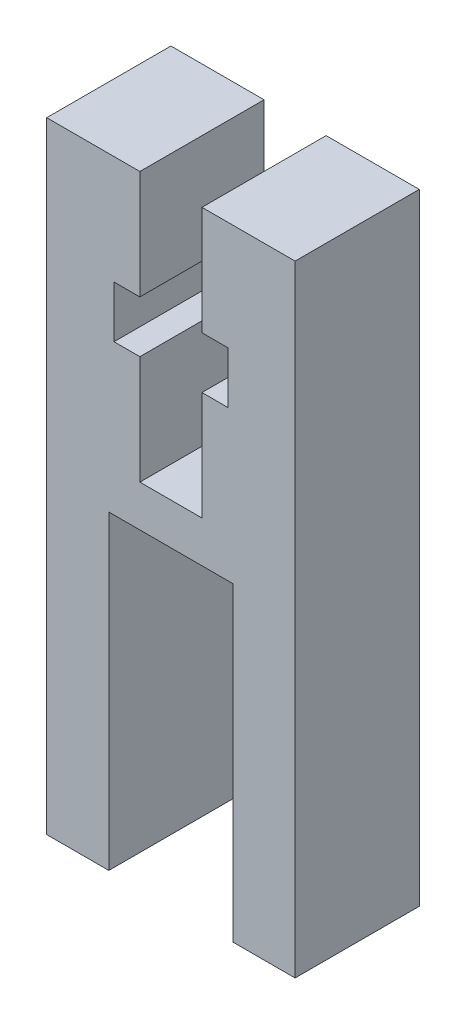
ISO-10303-21;
HEADER;
FILE_DESCRIPTION(('STEP AP214'),'2;1');
FILE_NAME('part.step','',(''),(''),'','','');
FILE_SCHEMA(('AUTOMOTIVE_DESIGN { 1 0 10303 214 1 1 1 1 }'));
ENDSEC;
DATA;
#1=APPLICATION_CONTEXT('core data for automotive mechanical design processes');
#2=APPLICATION_PROTOCOL_DEFINITION('international standard','automotive_design',2000,#1);
#3=PRODUCT_CONTEXT('',#1,'mechanical');
#4=PRODUCT('Part','Part','',(#3));
#5=PRODUCT_RELATED_PRODUCT_CATEGORY('part','',(#4));
#6=PRODUCT_DEFINITION_FORMATION('','',#4);
#7=PRODUCT_DEFINITION_CONTEXT('part definition',#1,'design');
#8=PRODUCT_DEFINITION('design','',#6,#7);
#9=PRODUCT_DEFINITION_SHAPE('','',#8);
#10=(LENGTH_UNIT() NAMED_UNIT(*) SI_UNIT(.MILLI.,.METRE.));
#11=(NAMED_UNIT(*) PLANE_ANGLE_UNIT() SI_UNIT($,.RADIAN.));
#12=(NAMED_UNIT(*) SI_UNIT($,.STERADIAN.) SOLID_ANGLE_UNIT());
#13=UNCERTAINTY_MEASURE_WITH_UNIT(LENGTH_MEASURE(1.E-05),#10,'distance_accuracy_value','');
#14=(GEOMETRIC_REPRESENTATION_CONTEXT(3) GLOBAL_UNCERTAINTY_ASSIGNED_CONTEXT((#13)) GLOBAL_UNIT_ASSIGNED_CONTEXT((#10,
#11,#12)) REPRESENTATION_CONTEXT('',''));
#15=CARTESIAN_POINT('',(0.,0.,0.));
#16=DIRECTION('',(0.,0.,1.));
#17=DIRECTION('',(1.,0.,0.));
#18=AXIS2_PLACEMENT_3D('',#15,#16,#17);
#19=CARTESIAN_POINT('',(-1.5,30.,6.));
#20=DIRECTION('',(0.,-1.,0.));
#21=DIRECTION('',(1.,0.,0.));
#22=AXIS2_PLACEMENT_3D('',#19,#20,#21);
#23=PLANE('',#22);
#24=DIRECTION('',(-1.,0.,0.));
#25=VECTOR('',#24,1.);
#26=CARTESIAN_POINT('',(-1.5,30.,0.));
#27=LINE('',#26,#25);
#28=CARTESIAN_POINT('',(-1.5,30.,0.));
#29=VERTEX_POINT('',#28);
#30=CARTESIAN_POINT('',(-6.,30.,0.));
#31=VERTEX_POINT('',#30);
#32=EDGE_CURVE('E212',#29,#31,#27,.T.);
#33=ORIENTED_EDGE('',*,*,#32,.T.);
#34=DIRECTION('',(0.,0.,-1.));
#35=VECTOR('',#34,1.);
#36=CARTESIAN_POINT('',(-6.,30.,6.));
#37=LINE('',#36,#35);
#38=CARTESIAN_POINT('',(-6.,30.,6.));
#39=VERTEX_POINT('',#38);
#40=EDGE_CURVE('E11',#39,#31,#37,.T.);
#41=ORIENTED_EDGE('',*,*,#40,.F.);
#42=DIRECTION('',(-1.,0.,0.));
#43=VECTOR('',#42,1.);
#44=CARTESIAN_POINT('',(-1.5,30.,6.));
#45=LINE('',#44,#43);
#46=CARTESIAN_POINT('',(-1.5,30.,6.));
#47=VERTEX_POINT('',#46);
#48=EDGE_CURVE('E270',#47,#39,#45,.T.);
#49=ORIENTED_EDGE('',*,*,#48,.F.);
#50=DIRECTION('',(0.,0.,-1.));
#51=VECTOR('',#50,1.);
#52=CARTESIAN_POINT('',(-1.5,30.,6.));
#53=LINE('',#52,#51);
#54=EDGE_CURVE('E208',#47,#29,#53,.T.);
#55=ORIENTED_EDGE('',*,*,#54,.T.);
#56=EDGE_LOOP('',(#33,#41,#49,#55));
#57=FACE_BOUND('',#56,.T.);
#58=ADVANCED_FACE('F39',(#57),#23,.F.);
#59=CARTESIAN_POINT('',(-6.,30.,6.));
#60=DIRECTION('',(1.,0.,0.));
#61=DIRECTION('',(0.,1.,0.));
#62=AXIS2_PLACEMENT_3D('',#59,#60,#61);
#63=PLANE('',#62);
#64=DIRECTION('',(0.,-1.,0.));
#65=VECTOR('',#64,1.);
#66=CARTESIAN_POINT('',(-6.,30.,0.));
#67=LINE('',#66,#65);
#68=CARTESIAN_POINT('',(-5.99999999999999,0.,0.));
#69=VERTEX_POINT('',#68);
#70=EDGE_CURVE('E216',#31,#69,#67,.T.);
#71=ORIENTED_EDGE('',*,*,#70,.T.);
#72=DIRECTION('',(0.,0.,-1.));
#73=VECTOR('',#72,1.);
#74=CARTESIAN_POINT('',(-5.99999999999999,0.,6.));
#75=LINE('',#74,#73);
#76=CARTESIAN_POINT('',(-5.99999999999999,0.,6.));
#77=VERTEX_POINT('',#76);
#78=EDGE_CURVE('E48',#77,#69,#75,.T.);
#79=ORIENTED_EDGE('',*,*,#78,.F.);
#80=DIRECTION('',(0.,-1.,0.));
#81=VECTOR('',#80,1.);
#82=CARTESIAN_POINT('',(-6.,30.,6.));
#83=LINE('',#82,#81);
#84=EDGE_CURVE('E135',#39,#77,#83,.T.);
#85=ORIENTED_EDGE('',*,*,#84,.F.);
#86=ORIENTED_EDGE('',*,*,#40,.T.);
#87=EDGE_LOOP('',(#71,#79,#85,#86));
#88=FACE_BOUND('',#87,.T.);
#89=ADVANCED_FACE('F420',(#88),#63,.F.);
#90=CARTESIAN_POINT('',(-5.99999999999999,0.,6.));
#91=DIRECTION('',(0.,1.,0.));
#92=DIRECTION('',(0.,0.,1.));
#93=AXIS2_PLACEMENT_3D('',#90,#91,#92);
#94=PLANE('',#93);
#95=DIRECTION('',(1.,0.,0.));
#96=VECTOR('',#95,1.);
#97=CARTESIAN_POINT('',(-5.99999999999999,0.,0.));
#98=LINE('',#97,#96);
#99=CARTESIAN_POINT('',(-3.,0.,0.));
#100=VERTEX_POINT('',#99);
#101=EDGE_CURVE('E219',#69,#100,#98,.T.);
#102=ORIENTED_EDGE('',*,*,#101,.T.);
#103=DIRECTION('',(0.,0.,-1.));
#104=VECTOR('',#103,1.);
#105=CARTESIAN_POINT('',(-3.,0.,6.));
#106=LINE('',#105,#104);
#107=CARTESIAN_POINT('',(-3.,0.,6.));
#108=VERTEX_POINT('',#107);
#109=EDGE_CURVE('E329',#108,#100,#106,.T.);
#110=ORIENTED_EDGE('',*,*,#109,.F.);
#111=DIRECTION('',(1.,0.,0.));
#112=VECTOR('',#111,1.);
#113=CARTESIAN_POINT('',(-5.99999999999999,0.,6.));
#114=LINE('',#113,#112);
#115=EDGE_CURVE('E339',#77,#108,#114,.T.);
#116=ORIENTED_EDGE('',*,*,#115,.F.);
#117=ORIENTED_EDGE('',*,*,#78,.T.);
#118=EDGE_LOOP('',(#102,#110,#116,#117));
#119=FACE_BOUND('',#118,.T.);
#120=ADVANCED_FACE('F337',(#119),#94,.F.);
#121=CARTESIAN_POINT('',(-3.,0.,6.));
#122=DIRECTION('',(-1.,0.,0.));
#123=DIRECTION('',(0.,0.,1.));
#124=AXIS2_PLACEMENT_3D('',#121,#122,#123);
#125=PLANE('',#124);
#126=DIRECTION('',(0.,1.,0.));
#127=VECTOR('',#126,1.);
#128=CARTESIAN_POINT('',(-3.,0.,0.));
#129=LINE('',#128,#127);
#130=CARTESIAN_POINT('',(-3.,15.,0.));
#131=VERTEX_POINT('',#130);
#132=EDGE_CURVE('E222',#100,#131,#129,.T.);
#133=ORIENTED_EDGE('',*,*,#132,.T.);
#134=DIRECTION('',(0.,0.,-1.));
#135=VECTOR('',#134,1.);
#136=CARTESIAN_POINT('',(-3.,15.,6.));
#137=LINE('',#136,#135);
#138=CARTESIAN_POINT('',(-3.,15.,6.));
#139=VERTEX_POINT('',#138);
#140=EDGE_CURVE('E325',#139,#131,#137,.T.);
#141=ORIENTED_EDGE('',*,*,#140,.F.);
#142=DIRECTION('',(0.,1.,0.));
#143=VECTOR('',#142,1.);
#144=CARTESIAN_POINT('',(-3.,0.,6.));
#145=LINE('',#144,#143);
#146=EDGE_CURVE('E358',#108,#139,#145,.T.);
#147=ORIENTED_EDGE('',*,*,#146,.F.);
#148=ORIENTED_EDGE('',*,*,#109,.T.);
#149=EDGE_LOOP('',(#133,#141,#147,#148));
#150=FACE_BOUND('',#149,.T.);
#151=ADVANCED_FACE('F348',(#150),#125,.F.);
#152=CARTESIAN_POINT('',(-3.,15.,6.));
#153=DIRECTION('',(0.,1.,0.));
#154=DIRECTION('',(0.,0.,1.));
#155=AXIS2_PLACEMENT_3D('',#152,#153,#154);
#156=PLANE('',#155);
#157=DIRECTION('',(1.,0.,0.));
#158=VECTOR('',#157,1.);
#159=CARTESIAN_POINT('',(-3.,15.,0.));
#160=LINE('',#159,#158);
#161=CARTESIAN_POINT('',(3.,15.,0.));
#162=VERTEX_POINT('',#161);
#163=EDGE_CURVE('E225',#131,#162,#160,.T.);
#164=ORIENTED_EDGE('',*,*,#163,.T.);
#165=DIRECTION('',(0.,0.,-1.));
#166=VECTOR('',#165,1.);
#167=CARTESIAN_POINT('',(3.,15.,6.));
#168=LINE('',#167,#166);
#169=CARTESIAN_POINT('',(3.,15.,6.));
#170=VERTEX_POINT('',#169);
#171=EDGE_CURVE('E321',#170,#162,#168,.T.);
#172=ORIENTED_EDGE('',*,*,#171,.F.);
#173=DIRECTION('',(1.,0.,0.));
#174=VECTOR('',#173,1.);
#175=CARTESIAN_POINT('',(-3.,15.,6.));
#176=LINE('',#175,#174);
#177=EDGE_CURVE('E354',#139,#170,#176,.T.);
#178=ORIENTED_EDGE('',*,*,#177,.F.);
#179=ORIENTED_EDGE('',*,*,#140,.T.);
#180=EDGE_LOOP('',(#164,#172,#178,#179));
#181=FACE_BOUND('',#180,.T.);
#182=ADVANCED_FACE('F352',(#181),#156,.F.);
#183=CARTESIAN_POINT('',(3.,0.,6.));
#184=DIRECTION('',(1.,0.,0.));
#185=DIRECTION('',(0.,0.,-1.));
#186=AXIS2_PLACEMENT_3D('',#183,#184,#185);
#187=PLANE('',#186);
#188=DIRECTION('',(0.,-1.,0.));
#189=VECTOR('',#188,1.);
#190=CARTESIAN_POINT('',(3.,0.,0.));
#191=LINE('',#190,#189);
#192=CARTESIAN_POINT('',(3.,0.,0.));
#193=VERTEX_POINT('',#192);
#194=EDGE_CURVE('E228',#162,#193,#191,.T.);
#195=ORIENTED_EDGE('',*,*,#194,.T.);
#196=DIRECTION('',(0.,0.,-1.));
#197=VECTOR('',#196,1.);
#198=CARTESIAN_POINT('',(3.,0.,6.));
#199=LINE('',#198,#197);
#200=CARTESIAN_POINT('',(3.,0.,6.));
#201=VERTEX_POINT('',#200);
#202=EDGE_CURVE('E317',#201,#193,#199,.T.);
#203=ORIENTED_EDGE('',*,*,#202,.F.);
#204=DIRECTION('',(0.,-1.,0.));
#205=VECTOR('',#204,1.);
#206=CARTESIAN_POINT('',(3.,0.,6.));
#207=LINE('',#206,#205);
#208=EDGE_CURVE('E357',#170,#201,#207,.T.);
#209=ORIENTED_EDGE('',*,*,#208,.F.);
#210=ORIENTED_EDGE('',*,*,#171,.T.);
#211=EDGE_LOOP('',(#195,#203,#209,#210));
#212=FACE_BOUND('',#211,.T.);
#213=ADVANCED_FACE('F433',(#212),#187,.F.);
#214=CARTESIAN_POINT('',(5.99999999999999,0.,6.));
#215=DIRECTION('',(0.,1.,0.));
#216=DIRECTION('',(0.,0.,1.));
#217=AXIS2_PLACEMENT_3D('',#214,#215,#216);
#218=PLANE('',#217);
#219=DIRECTION('',(1.,0.,0.));
#220=VECTOR('',#219,1.);
#221=CARTESIAN_POINT('',(5.99999999999999,0.,0.));
#222=LINE('',#221,#220);
#223=CARTESIAN_POINT('',(5.99999999999999,0.,0.));
#224=VERTEX_POINT('',#223);
#225=EDGE_CURVE('E231',#193,#224,#222,.T.);
#226=ORIENTED_EDGE('',*,*,#225,.T.);
#227=DIRECTION('',(0.,0.,-1.));
#228=VECTOR('',#227,1.);
#229=CARTESIAN_POINT('',(5.99999999999999,0.,6.));
#230=LINE('',#229,#228);
#231=CARTESIAN_POINT('',(5.99999999999999,0.,6.));
#232=VERTEX_POINT('',#231);
#233=EDGE_CURVE('E313',#232,#224,#230,.T.);
#234=ORIENTED_EDGE('',*,*,#233,.F.);
#235=DIRECTION('',(1.,0.,0.));
#236=VECTOR('',#235,1.);
#237=CARTESIAN_POINT('',(5.99999999999999,0.,6.));
#238=LINE('',#237,#236);
#239=EDGE_CURVE('E362',#201,#232,#238,.T.);
#240=ORIENTED_EDGE('',*,*,#239,.F.);
#241=ORIENTED_EDGE('',*,*,#202,.T.);
#242=EDGE_LOOP('',(#226,#234,#240,#241));
#243=FACE_BOUND('',#242,.T.);
#244=ADVANCED_FACE('F436',(#243),#218,.F.);
#245=CARTESIAN_POINT('',(6.,30.,6.));
#246=DIRECTION('',(-1.,0.,0.));
#247=DIRECTION('',(0.,-1.,0.));
#248=AXIS2_PLACEMENT_3D('',#245,#246,#247);
#249=PLANE('',#248);
#250=DIRECTION('',(0.,1.,0.));
#251=VECTOR('',#250,1.);
#252=CARTESIAN_POINT('',(6.,30.,0.));
#253=LINE('',#252,#251);
#254=CARTESIAN_POINT('',(6.,30.,0.));
#255=VERTEX_POINT('',#254);
#256=EDGE_CURVE('E234',#224,#255,#253,.T.);
#257=ORIENTED_EDGE('',*,*,#256,.T.);
#258=DIRECTION('',(0.,0.,-1.));
#259=VECTOR('',#258,1.);
#260=CARTESIAN_POINT('',(6.,30.,6.));
#261=LINE('',#260,#259);
#262=CARTESIAN_POINT('',(6.,30.,6.));
#263=VERTEX_POINT('',#262);
#264=EDGE_CURVE('E309',#263,#255,#261,.T.);
#265=ORIENTED_EDGE('',*,*,#264,.F.);
#266=DIRECTION('',(0.,1.,0.));
#267=VECTOR('',#266,1.);
#268=CARTESIAN_POINT('',(6.,30.,6.));
#269=LINE('',#268,#267);
#270=EDGE_CURVE('E369',#232,#263,#269,.T.);
#271=ORIENTED_EDGE('',*,*,#270,.F.);
#272=ORIENTED_EDGE('',*,*,#233,.T.);
#273=EDGE_LOOP('',(#257,#265,#271,#272));
#274=FACE_BOUND('',#273,.T.);
#275=ADVANCED_FACE('F440',(#274),#249,.F.);
#276=CARTESIAN_POINT('',(1.5,30.,6.));
#277=DIRECTION('',(0.,-1.,0.));
#278=DIRECTION('',(1.,0.,0.));
#279=AXIS2_PLACEMENT_3D('',#276,#277,#278);
#280=PLANE('',#279);
#281=DIRECTION('',(-1.,0.,0.));
#282=VECTOR('',#281,1.);
#283=CARTESIAN_POINT('',(1.5,30.,0.));
#284=LINE('',#283,#282);
#285=CARTESIAN_POINT('',(1.5,30.,0.));
#286=VERTEX_POINT('',#285);
#287=EDGE_CURVE('E237',#255,#286,#284,.T.);
#288=ORIENTED_EDGE('',*,*,#287,.T.);
#289=DIRECTION('',(0.,0.,-1.));
#290=VECTOR('',#289,1.);
#291=CARTESIAN_POINT('',(1.5,30.,6.));
#292=LINE('',#291,#290);
#293=CARTESIAN_POINT('',(1.5,30.,6.));
#294=VERTEX_POINT('',#293);
#295=EDGE_CURVE('E305',#294,#286,#292,.T.);
#296=ORIENTED_EDGE('',*,*,#295,.F.);
#297=DIRECTION('',(-1.,0.,0.));
#298=VECTOR('',#297,1.);
#299=CARTESIAN_POINT('',(1.5,30.,6.));
#300=LINE('',#299,#298);
#301=EDGE_CURVE('E372',#263,#294,#300,.T.);
#302=ORIENTED_EDGE('',*,*,#301,.F.);
#303=ORIENTED_EDGE('',*,*,#264,.T.);
#304=EDGE_LOOP('',(#288,#296,#302,#303));
#305=FACE_BOUND('',#304,.T.);
#306=ADVANCED_FACE('F444',(#305),#280,.F.);
#307=CARTESIAN_POINT('',(1.5,30.,6.));
#308=DIRECTION('',(1.,0.,0.));
#309=DIRECTION('',(0.,1.,0.));
#310=AXIS2_PLACEMENT_3D('',#307,#308,#309);
#311=PLANE('',#310);
#312=DIRECTION('',(0.,-1.,0.));
#313=VECTOR('',#312,1.);
#314=CARTESIAN_POINT('',(1.5,30.,0.));
#315=LINE('',#314,#313);
#316=CARTESIAN_POINT('',(1.5,24.75,0.));
#317=VERTEX_POINT('',#316);
#318=EDGE_CURVE('E240',#286,#317,#315,.T.);
#319=ORIENTED_EDGE('',*,*,#318,.T.);
#320=DIRECTION('',(0.,0.,-1.));
#321=VECTOR('',#320,1.);
#322=CARTESIAN_POINT('',(1.5,24.75,6.));
#323=LINE('',#322,#321);
#324=CARTESIAN_POINT('',(1.5,24.75,6.));
#325=VERTEX_POINT('',#324);
#326=EDGE_CURVE('E301',#325,#317,#323,.T.);
#327=ORIENTED_EDGE('',*,*,#326,.F.);
#328=DIRECTION('',(0.,-1.,0.));
#329=VECTOR('',#328,1.);
#330=CARTESIAN_POINT('',(1.5,30.,6.));
#331=LINE('',#330,#329);
#332=EDGE_CURVE('E375',#294,#325,#331,.T.);
#333=ORIENTED_EDGE('',*,*,#332,.F.);
#334=ORIENTED_EDGE('',*,*,#295,.T.);
#335=EDGE_LOOP('',(#319,#327,#333,#334));
#336=FACE_BOUND('',#335,.T.);
#337=ADVANCED_FACE('F448',(#336),#311,.F.);
#338=CARTESIAN_POINT('',(1.5,24.75,6.));
#339=DIRECTION('',(0.,1.,0.));
#340=DIRECTION('',(0.,0.,1.));
#341=AXIS2_PLACEMENT_3D('',#338,#339,#340);
#342=PLANE('',#341);
#343=DIRECTION('',(1.,0.,0.));
#344=VECTOR('',#343,1.);
#345=CARTESIAN_POINT('',(1.5,24.75,0.));
#346=LINE('',#345,#344);
#347=CARTESIAN_POINT('',(2.75,24.75,0.));
#348=VERTEX_POINT('',#347);
#349=EDGE_CURVE('E243',#317,#348,#346,.T.);
#350=ORIENTED_EDGE('',*,*,#349,.T.);
#351=DIRECTION('',(0.,0.,-1.));
#352=VECTOR('',#351,1.);
#353=CARTESIAN_POINT('',(2.75,24.75,6.));
#354=LINE('',#353,#352);
#355=CARTESIAN_POINT('',(2.75,24.75,6.));
#356=VERTEX_POINT('',#355);
#357=EDGE_CURVE('E297',#356,#348,#354,.T.);
#358=ORIENTED_EDGE('',*,*,#357,.F.);
#359=DIRECTION('',(1.,0.,0.));
#360=VECTOR('',#359,1.);
#361=CARTESIAN_POINT('',(1.5,24.75,6.));
#362=LINE('',#361,#360);
#363=EDGE_CURVE('E378',#325,#356,#362,.T.);
#364=ORIENTED_EDGE('',*,*,#363,.F.);
#365=ORIENTED_EDGE('',*,*,#326,.T.);
#366=EDGE_LOOP('',(#350,#358,#364,#365));
#367=FACE_BOUND('',#366,.T.);
#368=ADVANCED_FACE('F452',(#367),#342,.F.);
#369=CARTESIAN_POINT('',(2.75,24.75,6.));
#370=DIRECTION('',(1.,0.,0.));
#371=DIRECTION('',(0.,0.,-1.));
#372=AXIS2_PLACEMENT_3D('',#369,#370,#371);
#373=PLANE('',#372);
#374=DIRECTION('',(0.,-1.,0.));
#375=VECTOR('',#374,1.);
#376=CARTESIAN_POINT('',(2.75,24.75,0.));
#377=LINE('',#376,#375);
#378=CARTESIAN_POINT('',(2.75,22.25,0.));
#379=VERTEX_POINT('',#378);
#380=EDGE_CURVE('E246',#348,#379,#377,.T.);
#381=ORIENTED_EDGE('',*,*,#380,.T.);
#382=DIRECTION('',(0.,0.,-1.));
#383=VECTOR('',#382,1.);
#384=CARTESIAN_POINT('',(2.75,22.25,6.));
#385=LINE('',#384,#383);
#386=CARTESIAN_POINT('',(2.75,22.25,6.));
#387=VERTEX_POINT('',#386);
#388=EDGE_CURVE('E293',#387,#379,#385,.T.);
#389=ORIENTED_EDGE('',*,*,#388,.F.);
#390=DIRECTION('',(0.,-1.,0.));
#391=VECTOR('',#390,1.);
#392=CARTESIAN_POINT('',(2.75,24.75,6.));
#393=LINE('',#392,#391);
#394=EDGE_CURVE('E381',#356,#387,#393,.T.);
#395=ORIENTED_EDGE('',*,*,#394,.F.);
#396=ORIENTED_EDGE('',*,*,#357,.T.);
#397=EDGE_LOOP('',(#381,#389,#395,#396));
#398=FACE_BOUND('',#397,.T.);
#399=ADVANCED_FACE('F456',(#398),#373,.F.);
#400=CARTESIAN_POINT('',(2.75,22.25,6.));
#401=DIRECTION('',(0.,-1.,0.));
#402=DIRECTION('',(0.,0.,-1.));
#403=AXIS2_PLACEMENT_3D('',#400,#401,#402);
#404=PLANE('',#403);
#405=DIRECTION('',(-1.,0.,0.));
#406=VECTOR('',#405,1.);
#407=CARTESIAN_POINT('',(2.75,22.25,0.));
#408=LINE('',#407,#406);
#409=CARTESIAN_POINT('',(1.5,22.25,0.));
#410=VERTEX_POINT('',#409);
#411=EDGE_CURVE('E249',#379,#410,#408,.T.);
#412=ORIENTED_EDGE('',*,*,#411,.T.);
#413=DIRECTION('',(0.,0.,-1.));
#414=VECTOR('',#413,1.);
#415=CARTESIAN_POINT('',(1.5,22.25,6.));
#416=LINE('',#415,#414);
#417=CARTESIAN_POINT('',(1.5,22.25,6.));
#418=VERTEX_POINT('',#417);
#419=EDGE_CURVE('E289',#418,#410,#416,.T.);
#420=ORIENTED_EDGE('',*,*,#419,.F.);
#421=DIRECTION('',(-1.,0.,0.));
#422=VECTOR('',#421,1.);
#423=CARTESIAN_POINT('',(2.75,22.25,6.));
#424=LINE('',#423,#422);
#425=EDGE_CURVE('E384',#387,#418,#424,.T.);
#426=ORIENTED_EDGE('',*,*,#425,.F.);
#427=ORIENTED_EDGE('',*,*,#388,.T.);
#428=EDGE_LOOP('',(#412,#420,#426,#427));
#429=FACE_BOUND('',#428,.T.);
#430=ADVANCED_FACE('F460',(#429),#404,.F.);
#431=CARTESIAN_POINT('',(1.5,22.25,6.));
#432=DIRECTION('',(1.,0.,0.));
#433=DIRECTION('',(0.,1.,0.));
#434=AXIS2_PLACEMENT_3D('',#431,#432,#433);
#435=PLANE('',#434);
#436=DIRECTION('',(0.,-1.,0.));
#437=VECTOR('',#436,1.);
#438=CARTESIAN_POINT('',(1.5,22.25,0.));
#439=LINE('',#438,#437);
#440=CARTESIAN_POINT('',(1.5,17.0000000000001,0.));
#441=VERTEX_POINT('',#440);
#442=EDGE_CURVE('E252',#410,#441,#439,.T.);
#443=ORIENTED_EDGE('',*,*,#442,.T.);
#444=DIRECTION('',(0.,0.,-1.));
#445=VECTOR('',#444,1.);
#446=CARTESIAN_POINT('',(1.5,17.0000000000001,6.));
#447=LINE('',#446,#445);
#448=CARTESIAN_POINT('',(1.5,17.0000000000001,6.));
#449=VERTEX_POINT('',#448);
#450=EDGE_CURVE('E285',#449,#441,#447,.T.);
#451=ORIENTED_EDGE('',*,*,#450,.F.);
#452=DIRECTION('',(0.,-1.,0.));
#453=VECTOR('',#452,1.);
#454=CARTESIAN_POINT('',(1.5,22.25,6.));
#455=LINE('',#454,#453);
#456=EDGE_CURVE('E387',#418,#449,#455,.T.);
#457=ORIENTED_EDGE('',*,*,#456,.F.);
#458=ORIENTED_EDGE('',*,*,#419,.T.);
#459=EDGE_LOOP('',(#443,#451,#457,#458));
#460=FACE_BOUND('',#459,.T.);
#461=ADVANCED_FACE('F464',(#460),#435,.F.);
#462=CARTESIAN_POINT('',(-1.5,17.,6.));
#463=DIRECTION('',(0.,-1.,0.));
#464=DIRECTION('',(1.,0.,0.));
#465=AXIS2_PLACEMENT_3D('',#462,#463,#464);
#466=PLANE('',#465);
#467=DIRECTION('',(-1.,0.,0.));
#468=VECTOR('',#467,1.);
#469=CARTESIAN_POINT('',(-1.5,17.,0.));
#470=LINE('',#469,#468);
#471=CARTESIAN_POINT('',(-1.5,17.,0.));
#472=VERTEX_POINT('',#471);
#473=EDGE_CURVE('E255',#441,#472,#470,.T.);
#474=ORIENTED_EDGE('',*,*,#473,.T.);
#475=DIRECTION('',(0.,0.,-1.));
#476=VECTOR('',#475,1.);
#477=CARTESIAN_POINT('',(-1.5,17.,6.));
#478=LINE('',#477,#476);
#479=CARTESIAN_POINT('',(-1.5,17.,6.));
#480=VERTEX_POINT('',#479);
#481=EDGE_CURVE('E281',#480,#472,#478,.T.);
#482=ORIENTED_EDGE('',*,*,#481,.F.);
#483=DIRECTION('',(-1.,0.,0.));
#484=VECTOR('',#483,1.);
#485=CARTESIAN_POINT('',(-1.5,17.,6.));
#486=LINE('',#485,#484);
#487=EDGE_CURVE('E390',#449,#480,#486,.T.);
#488=ORIENTED_EDGE('',*,*,#487,.F.);
#489=ORIENTED_EDGE('',*,*,#450,.T.);
#490=EDGE_LOOP('',(#474,#482,#488,#489));
#491=FACE_BOUND('',#490,.T.);
#492=ADVANCED_FACE('F468',(#491),#466,.F.);
#493=CARTESIAN_POINT('',(-1.5,22.25,6.));
#494=DIRECTION('',(-1.,0.,0.));
#495=DIRECTION('',(0.,-1.,0.));
#496=AXIS2_PLACEMENT_3D('',#493,#494,#495);
#497=PLANE('',#496);
#498=DIRECTION('',(0.,1.,0.));
#499=VECTOR('',#498,1.);
#500=CARTESIAN_POINT('',(-1.5,22.25,0.));
#501=LINE('',#500,#499);
#502=CARTESIAN_POINT('',(-1.5,22.25,0.));
#503=VERTEX_POINT('',#502);
#504=EDGE_CURVE('E258',#472,#503,#501,.T.);
#505=ORIENTED_EDGE('',*,*,#504,.T.);
#506=DIRECTION('',(0.,0.,-1.));
#507=VECTOR('',#506,1.);
#508=CARTESIAN_POINT('',(-1.5,22.25,6.));
#509=LINE('',#508,#507);
#510=CARTESIAN_POINT('',(-1.5,22.25,6.));
#511=VERTEX_POINT('',#510);
#512=EDGE_CURVE('E277',#511,#503,#509,.T.);
#513=ORIENTED_EDGE('',*,*,#512,.F.);
#514=DIRECTION('',(0.,1.,0.));
#515=VECTOR('',#514,1.);
#516=CARTESIAN_POINT('',(-1.5,22.25,6.));
#517=LINE('',#516,#515);
#518=EDGE_CURVE('E393',#480,#511,#517,.T.);
#519=ORIENTED_EDGE('',*,*,#518,.F.);
#520=ORIENTED_EDGE('',*,*,#481,.T.);
#521=EDGE_LOOP('',(#505,#513,#519,#520));
#522=FACE_BOUND('',#521,.T.);
#523=ADVANCED_FACE('F401',(#522),#497,.F.);
#524=CARTESIAN_POINT('',(-2.75,22.25,6.));
#525=DIRECTION('',(0.,-1.,0.));
#526=DIRECTION('',(0.,0.,-1.));
#527=AXIS2_PLACEMENT_3D('',#524,#525,#526);
#528=PLANE('',#527);
#529=DIRECTION('',(-1.,0.,0.));
#530=VECTOR('',#529,1.);
#531=CARTESIAN_POINT('',(-2.75,22.25,0.));
#532=LINE('',#531,#530);
#533=CARTESIAN_POINT('',(-2.75,22.25,0.));
#534=VERTEX_POINT('',#533);
#535=EDGE_CURVE('E261',#503,#534,#532,.T.);
#536=ORIENTED_EDGE('',*,*,#535,.T.);
#537=DIRECTION('',(0.,0.,-1.));
#538=VECTOR('',#537,1.);
#539=CARTESIAN_POINT('',(-2.75,22.25,6.));
#540=LINE('',#539,#538);
#541=CARTESIAN_POINT('',(-2.75,22.25,6.));
#542=VERTEX_POINT('',#541);
#543=EDGE_CURVE('E201',#542,#534,#540,.T.);
#544=ORIENTED_EDGE('',*,*,#543,.F.);
#545=DIRECTION('',(-1.,0.,0.));
#546=VECTOR('',#545,1.);
#547=CARTESIAN_POINT('',(-2.75,22.25,6.));
#548=LINE('',#547,#546);
#549=EDGE_CURVE('E190',#511,#542,#548,.T.);
#550=ORIENTED_EDGE('',*,*,#549,.F.);
#551=ORIENTED_EDGE('',*,*,#512,.T.);
#552=EDGE_LOOP('',(#536,#544,#550,#551));
#553=FACE_BOUND('',#552,.T.);
#554=ADVANCED_FACE('F405',(#553),#528,.F.);
#555=CARTESIAN_POINT('',(-2.75,24.75,6.));
#556=DIRECTION('',(-1.,0.,0.));
#557=DIRECTION('',(0.,0.,1.));
#558=AXIS2_PLACEMENT_3D('',#555,#556,#557);
#559=PLANE('',#558);
#560=DIRECTION('',(0.,1.,0.));
#561=VECTOR('',#560,1.);
#562=CARTESIAN_POINT('',(-2.75,24.75,0.));
#563=LINE('',#562,#561);
#564=CARTESIAN_POINT('',(-2.75,24.75,0.));
#565=VERTEX_POINT('',#564);
#566=EDGE_CURVE('E199',#534,#565,#563,.T.);
#567=ORIENTED_EDGE('',*,*,#566,.T.);
#568=DIRECTION('',(0.,0.,-1.));
#569=VECTOR('',#568,1.);
#570=CARTESIAN_POINT('',(-2.75,24.75,6.));
#571=LINE('',#570,#569);
#572=CARTESIAN_POINT('',(-2.75,24.75,6.));
#573=VERTEX_POINT('',#572);
#574=EDGE_CURVE('E196',#573,#565,#571,.T.);
#575=ORIENTED_EDGE('',*,*,#574,.F.);
#576=DIRECTION('',(0.,1.,0.));
#577=VECTOR('',#576,1.);
#578=CARTESIAN_POINT('',(-2.75,24.75,6.));
#579=LINE('',#578,#577);
#580=EDGE_CURVE('E184',#542,#573,#579,.T.);
#581=ORIENTED_EDGE('',*,*,#580,.F.);
#582=ORIENTED_EDGE('',*,*,#543,.T.);
#583=EDGE_LOOP('',(#567,#575,#581,#582));
#584=FACE_BOUND('',#583,.T.);
#585=ADVANCED_FACE('F197',(#584),#559,.F.);
#586=CARTESIAN_POINT('',(-1.5,24.75,6.));
#587=DIRECTION('',(0.,1.,0.));
#588=DIRECTION('',(0.,0.,1.));
#589=AXIS2_PLACEMENT_3D('',#586,#587,#588);
#590=PLANE('',#589);
#591=DIRECTION('',(1.,0.,0.));
#592=VECTOR('',#591,1.);
#593=CARTESIAN_POINT('',(-1.5,24.75,0.));
#594=LINE('',#593,#592);
#595=CARTESIAN_POINT('',(-1.5,24.75,0.));
#596=VERTEX_POINT('',#595);
#597=EDGE_CURVE('E121',#565,#596,#594,.T.);
#598=ORIENTED_EDGE('',*,*,#597,.T.);
#599=DIRECTION('',(0.,0.,-1.));
#600=VECTOR('',#599,1.);
#601=CARTESIAN_POINT('',(-1.5,24.75,6.));
#602=LINE('',#601,#600);
#603=CARTESIAN_POINT('',(-1.5,24.75,6.));
#604=VERTEX_POINT('',#603);
#605=EDGE_CURVE('E202',#604,#596,#602,.T.);
#606=ORIENTED_EDGE('',*,*,#605,.F.);
#607=DIRECTION('',(1.,0.,0.));
#608=VECTOR('',#607,1.);
#609=CARTESIAN_POINT('',(-1.5,24.75,6.));
#610=LINE('',#609,#608);
#611=EDGE_CURVE('E188',#573,#604,#610,.T.);
#612=ORIENTED_EDGE('',*,*,#611,.F.);
#613=ORIENTED_EDGE('',*,*,#574,.T.);
#614=EDGE_LOOP('',(#598,#606,#612,#613));
#615=FACE_BOUND('',#614,.T.);
#616=ADVANCED_FACE('F204',(#615),#590,.F.);
#617=CARTESIAN_POINT('',(-1.5,30.,6.));
#618=DIRECTION('',(-1.,0.,0.));
#619=DIRECTION('',(0.,-1.,0.));
#620=AXIS2_PLACEMENT_3D('',#617,#618,#619);
#621=PLANE('',#620);
#622=DIRECTION('',(0.,1.,0.));
#623=VECTOR('',#622,1.);
#624=CARTESIAN_POINT('',(-1.5,30.,0.));
#625=LINE('',#624,#623);
#626=EDGE_CURVE('E127',#596,#29,#625,.T.);
#627=ORIENTED_EDGE('',*,*,#626,.T.);
#628=ORIENTED_EDGE('',*,*,#54,.F.);
#629=DIRECTION('',(0.,1.,0.));
#630=VECTOR('',#629,1.);
#631=CARTESIAN_POINT('',(-1.5,30.,6.));
#632=LINE('',#631,#630);
#633=EDGE_CURVE('E56',#604,#47,#632,.T.);
#634=ORIENTED_EDGE('',*,*,#633,.F.);
#635=ORIENTED_EDGE('',*,*,#605,.T.);
#636=EDGE_LOOP('',(#627,#628,#634,#635));
#637=FACE_BOUND('',#636,.T.);
#638=ADVANCED_FACE('F409',(#637),#621,.F.);
#639=CARTESIAN_POINT('',(0.,0.,6.));
#640=DIRECTION('',(0.,0.,1.));
#641=DIRECTION('',(1.,0.,0.));
#642=AXIS2_PLACEMENT_3D('',#639,#640,#641);
#643=PLANE('',#642);
#644=ORIENTED_EDGE('',*,*,#48,.T.);
#645=ORIENTED_EDGE('',*,*,#84,.T.);
#646=ORIENTED_EDGE('',*,*,#115,.T.);
#647=ORIENTED_EDGE('',*,*,#146,.T.);
#648=ORIENTED_EDGE('',*,*,#177,.T.);
#649=ORIENTED_EDGE('',*,*,#208,.T.);
#650=ORIENTED_EDGE('',*,*,#239,.T.);
#651=ORIENTED_EDGE('',*,*,#270,.T.);
#652=ORIENTED_EDGE('',*,*,#301,.T.);
#653=ORIENTED_EDGE('',*,*,#332,.T.);
#654=ORIENTED_EDGE('',*,*,#363,.T.);
#655=ORIENTED_EDGE('',*,*,#394,.T.);
#656=ORIENTED_EDGE('',*,*,#425,.T.);
#657=ORIENTED_EDGE('',*,*,#456,.T.);
#658=ORIENTED_EDGE('',*,*,#487,.T.);
#659=ORIENTED_EDGE('',*,*,#518,.T.);
#660=ORIENTED_EDGE('',*,*,#549,.T.);
#661=ORIENTED_EDGE('',*,*,#580,.T.);
#662=ORIENTED_EDGE('',*,*,#611,.T.);
#663=ORIENTED_EDGE('',*,*,#633,.T.);
#664=EDGE_LOOP('',(#644,#645,#646,#647,#648,#649,#650,#651,#652,#653,#654,#655,#656,#657,#658,
#659,#660,#661,#662,#663));
#665=FACE_BOUND('',#664,.T.);
#666=ADVANCED_FACE('F186',(#665),#643,.T.);
#667=CARTESIAN_POINT('',(0.,0.,0.));
#668=DIRECTION('',(0.,0.,1.));
#669=DIRECTION('',(1.,0.,0.));
#670=AXIS2_PLACEMENT_3D('',#667,#668,#669);
#671=PLANE('',#670);
#672=ORIENTED_EDGE('',*,*,#32,.F.);
#673=ORIENTED_EDGE('',*,*,#626,.F.);
#674=ORIENTED_EDGE('',*,*,#597,.F.);
#675=ORIENTED_EDGE('',*,*,#566,.F.);
#676=ORIENTED_EDGE('',*,*,#535,.F.);
#677=ORIENTED_EDGE('',*,*,#504,.F.);
#678=ORIENTED_EDGE('',*,*,#473,.F.);
#679=ORIENTED_EDGE('',*,*,#442,.F.);
#680=ORIENTED_EDGE('',*,*,#411,.F.);
#681=ORIENTED_EDGE('',*,*,#380,.F.);
#682=ORIENTED_EDGE('',*,*,#349,.F.);
#683=ORIENTED_EDGE('',*,*,#318,.F.);
#684=ORIENTED_EDGE('',*,*,#287,.F.);
#685=ORIENTED_EDGE('',*,*,#256,.F.);
#686=ORIENTED_EDGE('',*,*,#225,.F.);
#687=ORIENTED_EDGE('',*,*,#194,.F.);
#688=ORIENTED_EDGE('',*,*,#163,.F.);
#689=ORIENTED_EDGE('',*,*,#132,.F.);
#690=ORIENTED_EDGE('',*,*,#101,.F.);
#691=ORIENTED_EDGE('',*,*,#70,.F.);
#692=EDGE_LOOP('',(#672,#673,#674,#675,#676,#677,#678,#679,#680,#681,#682,#683,#684,#685,#686,
#687,#688,#689,#690,#691));
#693=FACE_BOUND('',#692,.T.);
#694=ADVANCED_FACE('F343',(#693),#671,.F.);
#695=CLOSED_SHELL('',(#58,#89,#120,#151,#182,#213,#244,#275,#306,#337,#368,#399,#430,#461,#492,
#523,#554,#585,#616,#638,#666,#694));
#696=MANIFOLD_SOLID_BREP('B2',#695);
#697=ADVANCED_BREP_SHAPE_REPRESENTATION('',(#18,#696),#14);
#698=SHAPE_DEFINITION_REPRESENTATION(#9,#697);
ENDSEC;
END-ISO-10303-21;
